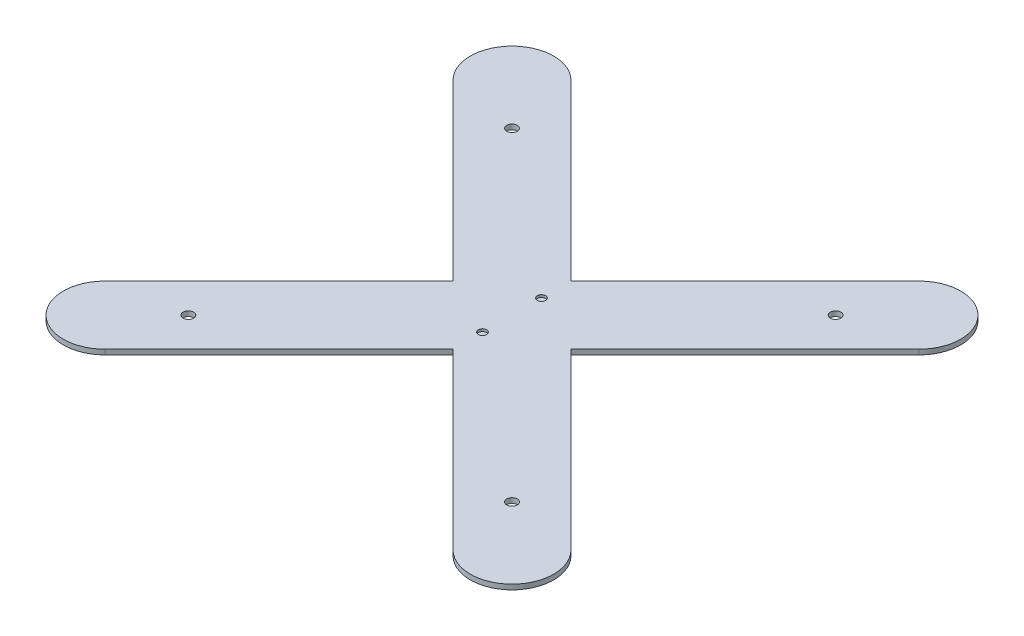
ISO-10303-21;
HEADER;
FILE_DESCRIPTION(('STEP AP214'),'2;1');
FILE_NAME('part.step','',(''),(''),'','','');
FILE_SCHEMA(('AUTOMOTIVE_DESIGN { 1 0 10303 214 1 1 1 1 }'));
ENDSEC;
DATA;
#1=APPLICATION_CONTEXT('core data for automotive mechanical design processes');
#2=APPLICATION_PROTOCOL_DEFINITION('international standard','automotive_design',2000,#1);
#3=PRODUCT_CONTEXT('',#1,'mechanical');
#4=PRODUCT('Part','Part','',(#3));
#5=PRODUCT_RELATED_PRODUCT_CATEGORY('part','',(#4));
#6=PRODUCT_DEFINITION_FORMATION('','',#4);
#7=PRODUCT_DEFINITION_CONTEXT('part definition',#1,'design');
#8=PRODUCT_DEFINITION('design','',#6,#7);
#9=PRODUCT_DEFINITION_SHAPE('','',#8);
#10=(LENGTH_UNIT() NAMED_UNIT(*) SI_UNIT(.MILLI.,.METRE.));
#11=(NAMED_UNIT(*) PLANE_ANGLE_UNIT() SI_UNIT($,.RADIAN.));
#12=(NAMED_UNIT(*) SI_UNIT($,.STERADIAN.) SOLID_ANGLE_UNIT());
#13=UNCERTAINTY_MEASURE_WITH_UNIT(LENGTH_MEASURE(1.E-05),#10,'distance_accuracy_value','');
#14=(GEOMETRIC_REPRESENTATION_CONTEXT(3) GLOBAL_UNCERTAINTY_ASSIGNED_CONTEXT((#13)) GLOBAL_UNIT_ASSIGNED_CONTEXT((#10,
#11,#12)) REPRESENTATION_CONTEXT('',''));
#15=CARTESIAN_POINT('',(0.,0.,0.));
#16=DIRECTION('',(0.,0.,1.));
#17=DIRECTION('',(1.,0.,0.));
#18=AXIS2_PLACEMENT_3D('',#15,#16,#17);
#19=CARTESIAN_POINT('',(122.,3.,122.));
#20=DIRECTION('',(0.,1.,0.));
#21=DIRECTION('',(0.,0.,1.));
#22=AXIS2_PLACEMENT_3D('',#19,#20,#21);
#23=PLANE('',#22);
#24=CARTESIAN_POINT('',(0.,3.,17.6776695296636));
#25=DIRECTION('',(0.,1.,0.));
#26=DIRECTION('',(0.,0.,-1.));
#27=AXIS2_PLACEMENT_3D('',#24,#25,#26);
#28=CIRCLE('',#27,2.5);
#29=CARTESIAN_POINT('',(0.,3.,15.1776695296636));
#30=VERTEX_POINT('',#29);
#31=EDGE_CURVE('E302',#30,#30,#28,.T.);
#32=ORIENTED_EDGE('',*,*,#31,.F.);
#33=EDGE_LOOP('',(#32));
#34=FACE_BOUND('',#33,.T.);
#35=CARTESIAN_POINT('',(0.,3.,-17.6776695296636));
#36=DIRECTION('',(0.,1.,0.));
#37=DIRECTION('',(0.,0.,1.));
#38=AXIS2_PLACEMENT_3D('',#35,#36,#37);
#39=CIRCLE('',#38,2.5);
#40=CARTESIAN_POINT('',(0.,3.,-15.1776695296636));
#41=VERTEX_POINT('',#40);
#42=EDGE_CURVE('E301',#41,#41,#39,.T.);
#43=ORIENTED_EDGE('',*,*,#42,.F.);
#44=EDGE_LOOP('',(#43));
#45=FACE_BOUND('',#44,.T.);
#46=CARTESIAN_POINT('',(96.9999999999999,3.,-97.));
#47=DIRECTION('',(0.,1.,0.));
#48=DIRECTION('',(0.,0.,1.));
#49=AXIS2_PLACEMENT_3D('',#46,#47,#48);
#50=CIRCLE('',#49,3.15);
#51=CARTESIAN_POINT('',(96.9999999999999,3.,-93.85));
#52=VERTEX_POINT('',#51);
#53=EDGE_CURVE('E319',#52,#52,#50,.T.);
#54=ORIENTED_EDGE('',*,*,#53,.F.);
#55=EDGE_LOOP('',(#54));
#56=FACE_BOUND('',#55,.T.);
#57=CARTESIAN_POINT('',(-97.,3.,-96.9999999999999));
#58=DIRECTION('',(0.,1.,0.));
#59=DIRECTION('',(0.,0.,1.));
#60=AXIS2_PLACEMENT_3D('',#57,#58,#59);
#61=CIRCLE('',#60,3.15);
#62=CARTESIAN_POINT('',(-97.,3.,-93.85));
#63=VERTEX_POINT('',#62);
#64=EDGE_CURVE('E158',#63,#63,#61,.T.);
#65=ORIENTED_EDGE('',*,*,#64,.F.);
#66=EDGE_LOOP('',(#65));
#67=FACE_BOUND('',#66,.T.);
#68=CARTESIAN_POINT('',(122.,3.,122.));
#69=DIRECTION('',(0.,1.,0.));
#70=DIRECTION('',(0.,0.,1.));
#71=AXIS2_PLACEMENT_3D('',#68,#69,#70);
#72=CIRCLE('',#71,25.);
#73=CARTESIAN_POINT('',(104.322330470336,3.,139.677669529664));
#74=VERTEX_POINT('',#73);
#75=CARTESIAN_POINT('',(139.677669529664,3.,104.322330470336));
#76=VERTEX_POINT('',#75);
#77=EDGE_CURVE('E177',#74,#76,#72,.T.);
#78=ORIENTED_EDGE('',*,*,#77,.T.);
#79=DIRECTION('',(-0.707106781186547,0.,-0.707106781186548));
#80=VECTOR('',#79,1.);
#81=CARTESIAN_POINT('',(139.677669529664,3.,104.322330470336));
#82=LINE('',#81,#80);
#83=CARTESIAN_POINT('',(35.3553390593272,3.,0.));
#84=VERTEX_POINT('',#83);
#85=EDGE_CURVE('E105',#76,#84,#82,.T.);
#86=ORIENTED_EDGE('',*,*,#85,.T.);
#87=DIRECTION('',(0.707106781186547,0.,-0.707106781186548));
#88=VECTOR('',#87,1.);
#89=CARTESIAN_POINT('',(35.3553390593272,3.,0.));
#90=LINE('',#89,#88);
#91=CARTESIAN_POINT('',(139.677669529664,3.,-104.322330470336));
#92=VERTEX_POINT('',#91);
#93=EDGE_CURVE('E204',#84,#92,#90,.T.);
#94=ORIENTED_EDGE('',*,*,#93,.T.);
#95=CARTESIAN_POINT('',(122.,3.,-122.));
#96=DIRECTION('',(0.,1.,0.));
#97=DIRECTION('',(0.,0.,1.));
#98=AXIS2_PLACEMENT_3D('',#95,#96,#97);
#99=CIRCLE('',#98,24.9999999999999);
#100=CARTESIAN_POINT('',(104.322330470336,3.,-139.677669529664));
#101=VERTEX_POINT('',#100);
#102=EDGE_CURVE('E223',#92,#101,#99,.T.);
#103=ORIENTED_EDGE('',*,*,#102,.T.);
#104=DIRECTION('',(-0.707106781186547,0.,0.707106781186548));
#105=VECTOR('',#104,1.);
#106=CARTESIAN_POINT('',(0.,3.,-35.3553390593272));
#107=LINE('',#106,#105);
#108=CARTESIAN_POINT('',(0.,3.,-35.3553390593272));
#109=VERTEX_POINT('',#108);
#110=EDGE_CURVE('E220',#101,#109,#107,.T.);
#111=ORIENTED_EDGE('',*,*,#110,.T.);
#112=DIRECTION('',(-0.707106781186547,0.,-0.707106781186548));
#113=VECTOR('',#112,1.);
#114=CARTESIAN_POINT('',(0.,3.,-35.3553390593272));
#115=LINE('',#114,#113);
#116=CARTESIAN_POINT('',(-104.322330470336,3.,-139.677669529664));
#117=VERTEX_POINT('',#116);
#118=EDGE_CURVE('E222',#109,#117,#115,.T.);
#119=ORIENTED_EDGE('',*,*,#118,.T.);
#120=CARTESIAN_POINT('',(-122.,3.,-122.));
#121=DIRECTION('',(0.,1.,0.));
#122=DIRECTION('',(0.,0.,1.));
#123=AXIS2_PLACEMENT_3D('',#120,#121,#122);
#124=CIRCLE('',#123,25.);
#125=CARTESIAN_POINT('',(-139.677669529664,3.,-104.322330470336));
#126=VERTEX_POINT('',#125);
#127=EDGE_CURVE('E225',#117,#126,#124,.T.);
#128=ORIENTED_EDGE('',*,*,#127,.T.);
#129=DIRECTION('',(0.707106781186547,0.,0.707106781186548));
#130=VECTOR('',#129,1.);
#131=CARTESIAN_POINT('',(-35.3553390593274,3.,0.));
#132=LINE('',#131,#130);
#133=CARTESIAN_POINT('',(-35.3553390593274,3.,0.));
#134=VERTEX_POINT('',#133);
#135=EDGE_CURVE('E231',#126,#134,#132,.T.);
#136=ORIENTED_EDGE('',*,*,#135,.T.);
#137=DIRECTION('',(-0.707106781186547,0.,0.707106781186548));
#138=VECTOR('',#137,1.);
#139=CARTESIAN_POINT('',(-139.677669529664,3.,104.322330470337));
#140=LINE('',#139,#138);
#141=CARTESIAN_POINT('',(-139.677669529664,3.,104.322330470337));
#142=VERTEX_POINT('',#141);
#143=EDGE_CURVE('E136',#134,#142,#140,.T.);
#144=ORIENTED_EDGE('',*,*,#143,.T.);
#145=CARTESIAN_POINT('',(-122.,3.,122.));
#146=DIRECTION('',(0.,1.,0.));
#147=DIRECTION('',(0.,0.,1.));
#148=AXIS2_PLACEMENT_3D('',#145,#146,#147);
#149=CIRCLE('',#148,24.9999999999999);
#150=CARTESIAN_POINT('',(-104.322330470337,3.,139.677669529664));
#151=VERTEX_POINT('',#150);
#152=EDGE_CURVE('E130',#142,#151,#149,.T.);
#153=ORIENTED_EDGE('',*,*,#152,.T.);
#154=DIRECTION('',(0.707106781186548,0.,-0.707106781186547));
#155=VECTOR('',#154,1.);
#156=CARTESIAN_POINT('',(-104.322330470337,3.,139.677669529664));
#157=LINE('',#156,#155);
#158=CARTESIAN_POINT('',(-1.52655665885959E-13,3.,35.3553390593274));
#159=VERTEX_POINT('',#158);
#160=EDGE_CURVE('E134',#151,#159,#157,.T.);
#161=ORIENTED_EDGE('',*,*,#160,.T.);
#162=DIRECTION('',(0.707106781186548,0.,0.707106781186547));
#163=VECTOR('',#162,1.);
#164=CARTESIAN_POINT('',(104.322330470336,3.,139.677669529664));
#165=LINE('',#164,#163);
#166=EDGE_CURVE('E50',#159,#74,#165,.T.);
#167=ORIENTED_EDGE('',*,*,#166,.T.);
#168=EDGE_LOOP('',(#78,#86,#94,#103,#111,#119,#128,#136,#144,#153,#161,#167));
#169=FACE_BOUND('',#168,.T.);
#170=CARTESIAN_POINT('',(96.9999999999999,3.,97.0000000000001));
#171=DIRECTION('',(0.,1.,0.));
#172=DIRECTION('',(0.,0.,-1.));
#173=AXIS2_PLACEMENT_3D('',#170,#171,#172);
#174=CIRCLE('',#173,3.15);
#175=CARTESIAN_POINT('',(96.9999999999999,3.,93.8500000000001));
#176=VERTEX_POINT('',#175);
#177=EDGE_CURVE('E325',#176,#176,#174,.T.);
#178=ORIENTED_EDGE('',*,*,#177,.F.);
#179=EDGE_LOOP('',(#178));
#180=FACE_BOUND('',#179,.T.);
#181=CARTESIAN_POINT('',(-97.,3.,97.));
#182=DIRECTION('',(0.,1.,0.));
#183=DIRECTION('',(0.,0.,-1.));
#184=AXIS2_PLACEMENT_3D('',#181,#182,#183);
#185=CIRCLE('',#184,3.15);
#186=CARTESIAN_POINT('',(-97.,3.,93.85));
#187=VERTEX_POINT('',#186);
#188=EDGE_CURVE('E313',#187,#187,#185,.T.);
#189=ORIENTED_EDGE('',*,*,#188,.F.);
#190=EDGE_LOOP('',(#189));
#191=FACE_BOUND('',#190,.T.);
#192=ADVANCED_FACE('F33',(#34,#45,#56,#67,#169,#180,#191),#23,.T.);
#193=CARTESIAN_POINT('',(122.,0.,122.));
#194=DIRECTION('',(0.,1.,0.));
#195=DIRECTION('',(0.,0.,1.));
#196=AXIS2_PLACEMENT_3D('',#193,#194,#195);
#197=PLANE('',#196);
#198=CARTESIAN_POINT('',(96.9999999999999,0.,-97.));
#199=DIRECTION('',(0.,1.,0.));
#200=DIRECTION('',(0.,0.,1.));
#201=AXIS2_PLACEMENT_3D('',#198,#199,#200);
#202=CIRCLE('',#201,3.15);
#203=CARTESIAN_POINT('',(96.9999999999999,0.,-93.85));
#204=VERTEX_POINT('',#203);
#205=EDGE_CURVE('E316',#204,#204,#202,.T.);
#206=ORIENTED_EDGE('',*,*,#205,.T.);
#207=EDGE_LOOP('',(#206));
#208=FACE_BOUND('',#207,.T.);
#209=CARTESIAN_POINT('',(-97.,0.,-96.9999999999999));
#210=DIRECTION('',(0.,1.,0.));
#211=DIRECTION('',(0.,0.,1.));
#212=AXIS2_PLACEMENT_3D('',#209,#210,#211);
#213=CIRCLE('',#212,3.15);
#214=CARTESIAN_POINT('',(-97.,0.,-93.85));
#215=VERTEX_POINT('',#214);
#216=EDGE_CURVE('E328',#215,#215,#213,.T.);
#217=ORIENTED_EDGE('',*,*,#216,.T.);
#218=EDGE_LOOP('',(#217));
#219=FACE_BOUND('',#218,.T.);
#220=CARTESIAN_POINT('',(122.,0.,122.));
#221=DIRECTION('',(0.,1.,0.));
#222=DIRECTION('',(0.,0.,1.));
#223=AXIS2_PLACEMENT_3D('',#220,#221,#222);
#224=CIRCLE('',#223,25.);
#225=CARTESIAN_POINT('',(104.322330470336,0.,139.677669529664));
#226=VERTEX_POINT('',#225);
#227=CARTESIAN_POINT('',(139.677669529664,0.,104.322330470336));
#228=VERTEX_POINT('',#227);
#229=EDGE_CURVE('E154',#226,#228,#224,.T.);
#230=ORIENTED_EDGE('',*,*,#229,.F.);
#231=DIRECTION('',(0.707106781186548,0.,0.707106781186547));
#232=VECTOR('',#231,1.);
#233=CARTESIAN_POINT('',(104.322330470336,0.,139.677669529664));
#234=LINE('',#233,#232);
#235=CARTESIAN_POINT('',(-1.52655665885959E-13,0.,35.3553390593274));
#236=VERTEX_POINT('',#235);
#237=EDGE_CURVE('E97',#236,#226,#234,.T.);
#238=ORIENTED_EDGE('',*,*,#237,.F.);
#239=DIRECTION('',(0.707106781186548,0.,-0.707106781186547));
#240=VECTOR('',#239,1.);
#241=CARTESIAN_POINT('',(-104.322330470337,0.,139.677669529664));
#242=LINE('',#241,#240);
#243=CARTESIAN_POINT('',(-104.322330470337,0.,139.677669529664));
#244=VERTEX_POINT('',#243);
#245=EDGE_CURVE('E91',#244,#236,#242,.T.);
#246=ORIENTED_EDGE('',*,*,#245,.F.);
#247=CARTESIAN_POINT('',(-122.,0.,122.));
#248=DIRECTION('',(0.,1.,0.));
#249=DIRECTION('',(0.,0.,1.));
#250=AXIS2_PLACEMENT_3D('',#247,#248,#249);
#251=CIRCLE('',#250,24.9999999999999);
#252=CARTESIAN_POINT('',(-139.677669529664,0.,104.322330470337));
#253=VERTEX_POINT('',#252);
#254=EDGE_CURVE('E144',#253,#244,#251,.T.);
#255=ORIENTED_EDGE('',*,*,#254,.F.);
#256=DIRECTION('',(-0.707106781186547,0.,0.707106781186548));
#257=VECTOR('',#256,1.);
#258=CARTESIAN_POINT('',(-139.677669529664,0.,104.322330470337));
#259=LINE('',#258,#257);
#260=CARTESIAN_POINT('',(-35.3553390593274,0.,0.));
#261=VERTEX_POINT('',#260);
#262=EDGE_CURVE('E172',#261,#253,#259,.T.);
#263=ORIENTED_EDGE('',*,*,#262,.F.);
#264=DIRECTION('',(0.707106781186547,0.,0.707106781186548));
#265=VECTOR('',#264,1.);
#266=CARTESIAN_POINT('',(-35.3553390593274,0.,0.));
#267=LINE('',#266,#265);
#268=CARTESIAN_POINT('',(-139.677669529664,0.,-104.322330470336));
#269=VERTEX_POINT('',#268);
#270=EDGE_CURVE('E170',#269,#261,#267,.T.);
#271=ORIENTED_EDGE('',*,*,#270,.F.);
#272=CARTESIAN_POINT('',(-122.,0.,-122.));
#273=DIRECTION('',(0.,1.,0.));
#274=DIRECTION('',(0.,0.,1.));
#275=AXIS2_PLACEMENT_3D('',#272,#273,#274);
#276=CIRCLE('',#275,25.);
#277=CARTESIAN_POINT('',(-104.322330470336,0.,-139.677669529664));
#278=VERTEX_POINT('',#277);
#279=EDGE_CURVE('E168',#278,#269,#276,.T.);
#280=ORIENTED_EDGE('',*,*,#279,.F.);
#281=DIRECTION('',(-0.707106781186547,0.,-0.707106781186548));
#282=VECTOR('',#281,1.);
#283=CARTESIAN_POINT('',(0.,0.,-35.3553390593272));
#284=LINE('',#283,#282);
#285=CARTESIAN_POINT('',(0.,0.,-35.3553390593272));
#286=VERTEX_POINT('',#285);
#287=EDGE_CURVE('E166',#286,#278,#284,.T.);
#288=ORIENTED_EDGE('',*,*,#287,.F.);
#289=DIRECTION('',(-0.707106781186547,0.,0.707106781186548));
#290=VECTOR('',#289,1.);
#291=CARTESIAN_POINT('',(0.,0.,-35.3553390593272));
#292=LINE('',#291,#290);
#293=CARTESIAN_POINT('',(104.322330470336,0.,-139.677669529664));
#294=VERTEX_POINT('',#293);
#295=EDGE_CURVE('E164',#294,#286,#292,.T.);
#296=ORIENTED_EDGE('',*,*,#295,.F.);
#297=CARTESIAN_POINT('',(122.,0.,-122.));
#298=DIRECTION('',(0.,1.,0.));
#299=DIRECTION('',(0.,0.,1.));
#300=AXIS2_PLACEMENT_3D('',#297,#298,#299);
#301=CIRCLE('',#300,24.9999999999999);
#302=CARTESIAN_POINT('',(139.677669529664,0.,-104.322330470336));
#303=VERTEX_POINT('',#302);
#304=EDGE_CURVE('E162',#303,#294,#301,.T.);
#305=ORIENTED_EDGE('',*,*,#304,.F.);
#306=DIRECTION('',(0.707106781186547,0.,-0.707106781186548));
#307=VECTOR('',#306,1.);
#308=CARTESIAN_POINT('',(35.3553390593272,0.,0.));
#309=LINE('',#308,#307);
#310=CARTESIAN_POINT('',(35.3553390593272,0.,0.));
#311=VERTEX_POINT('',#310);
#312=EDGE_CURVE('E160',#311,#303,#309,.T.);
#313=ORIENTED_EDGE('',*,*,#312,.F.);
#314=DIRECTION('',(-0.707106781186547,0.,-0.707106781186548));
#315=VECTOR('',#314,1.);
#316=CARTESIAN_POINT('',(139.677669529664,0.,104.322330470336));
#317=LINE('',#316,#315);
#318=EDGE_CURVE('E157',#228,#311,#317,.T.);
#319=ORIENTED_EDGE('',*,*,#318,.F.);
#320=EDGE_LOOP('',(#230,#238,#246,#255,#263,#271,#280,#288,#296,#305,#313,#319));
#321=FACE_BOUND('',#320,.T.);
#322=CARTESIAN_POINT('',(96.9999999999999,0.,97.0000000000001));
#323=DIRECTION('',(0.,1.,0.));
#324=DIRECTION('',(0.,0.,-1.));
#325=AXIS2_PLACEMENT_3D('',#322,#323,#324);
#326=CIRCLE('',#325,3.15);
#327=CARTESIAN_POINT('',(96.9999999999999,0.,93.8500000000001));
#328=VERTEX_POINT('',#327);
#329=EDGE_CURVE('E322',#328,#328,#326,.T.);
#330=ORIENTED_EDGE('',*,*,#329,.T.);
#331=EDGE_LOOP('',(#330));
#332=FACE_BOUND('',#331,.T.);
#333=CARTESIAN_POINT('',(-97.,0.,97.));
#334=DIRECTION('',(0.,1.,0.));
#335=DIRECTION('',(0.,0.,-1.));
#336=AXIS2_PLACEMENT_3D('',#333,#334,#335);
#337=CIRCLE('',#336,3.15);
#338=CARTESIAN_POINT('',(-97.,0.,93.85));
#339=VERTEX_POINT('',#338);
#340=EDGE_CURVE('E311',#339,#339,#337,.T.);
#341=ORIENTED_EDGE('',*,*,#340,.T.);
#342=EDGE_LOOP('',(#341));
#343=FACE_BOUND('',#342,.T.);
#344=ADVANCED_FACE('F208',(#208,#219,#321,#332,#343),#197,.F.);
#345=CARTESIAN_POINT('',(122.,3.,122.));
#346=DIRECTION('',(0.,-1.,0.));
#347=DIRECTION('',(0.,0.,-1.));
#348=AXIS2_PLACEMENT_3D('',#345,#346,#347);
#349=CYLINDRICAL_SURFACE('',#348,25.);
#350=ORIENTED_EDGE('',*,*,#229,.T.);
#351=DIRECTION('',(0.,-1.,0.));
#352=VECTOR('',#351,1.);
#353=CARTESIAN_POINT('',(139.677669529664,3.,104.322330470336));
#354=LINE('',#353,#352);
#355=EDGE_CURVE('E11',#76,#228,#354,.T.);
#356=ORIENTED_EDGE('',*,*,#355,.F.);
#357=ORIENTED_EDGE('',*,*,#77,.F.);
#358=DIRECTION('',(0.,-1.,0.));
#359=VECTOR('',#358,1.);
#360=CARTESIAN_POINT('',(104.322330470336,3.,139.677669529664));
#361=LINE('',#360,#359);
#362=EDGE_CURVE('E150',#74,#226,#361,.T.);
#363=ORIENTED_EDGE('',*,*,#362,.T.);
#364=EDGE_LOOP('',(#350,#356,#357,#363));
#365=FACE_BOUND('',#364,.T.);
#366=ADVANCED_FACE('F35',(#365),#349,.T.);
#367=CARTESIAN_POINT('',(139.677669529664,3.,104.322330470336));
#368=DIRECTION('',(-0.707106781186548,0.,0.707106781186547));
#369=DIRECTION('',(0.707106781186547,0.,0.707106781186548));
#370=AXIS2_PLACEMENT_3D('',#367,#368,#369);
#371=PLANE('',#370);
#372=ORIENTED_EDGE('',*,*,#318,.T.);
#373=DIRECTION('',(0.,-1.,0.));
#374=VECTOR('',#373,1.);
#375=CARTESIAN_POINT('',(35.3553390593272,3.,0.));
#376=LINE('',#375,#374);
#377=EDGE_CURVE('E42',#84,#311,#376,.T.);
#378=ORIENTED_EDGE('',*,*,#377,.F.);
#379=ORIENTED_EDGE('',*,*,#85,.F.);
#380=ORIENTED_EDGE('',*,*,#355,.T.);
#381=EDGE_LOOP('',(#372,#378,#379,#380));
#382=FACE_BOUND('',#381,.T.);
#383=ADVANCED_FACE('F462',(#382),#371,.F.);
#384=CARTESIAN_POINT('',(35.3553390593272,3.,0.));
#385=DIRECTION('',(-0.707106781186548,0.,-0.707106781186547));
#386=DIRECTION('',(-0.707106781186547,0.,0.707106781186548));
#387=AXIS2_PLACEMENT_3D('',#384,#385,#386);
#388=PLANE('',#387);
#389=ORIENTED_EDGE('',*,*,#312,.T.);
#390=DIRECTION('',(0.,-1.,0.));
#391=VECTOR('',#390,1.);
#392=CARTESIAN_POINT('',(139.677669529664,3.,-104.322330470336));
#393=LINE('',#392,#391);
#394=EDGE_CURVE('E196',#92,#303,#393,.T.);
#395=ORIENTED_EDGE('',*,*,#394,.F.);
#396=ORIENTED_EDGE('',*,*,#93,.F.);
#397=ORIENTED_EDGE('',*,*,#377,.T.);
#398=EDGE_LOOP('',(#389,#395,#396,#397));
#399=FACE_BOUND('',#398,.T.);
#400=ADVANCED_FACE('F202',(#399),#388,.F.);
#401=CARTESIAN_POINT('',(122.,3.,-122.));
#402=DIRECTION('',(0.,-1.,0.));
#403=DIRECTION('',(0.,0.,-1.));
#404=AXIS2_PLACEMENT_3D('',#401,#402,#403);
#405=CYLINDRICAL_SURFACE('',#404,24.9999999999999);
#406=ORIENTED_EDGE('',*,*,#304,.T.);
#407=DIRECTION('',(0.,-1.,0.));
#408=VECTOR('',#407,1.);
#409=CARTESIAN_POINT('',(104.322330470336,3.,-139.677669529664));
#410=LINE('',#409,#408);
#411=EDGE_CURVE('E193',#101,#294,#410,.T.);
#412=ORIENTED_EDGE('',*,*,#411,.F.);
#413=ORIENTED_EDGE('',*,*,#102,.F.);
#414=ORIENTED_EDGE('',*,*,#394,.T.);
#415=EDGE_LOOP('',(#406,#412,#413,#414));
#416=FACE_BOUND('',#415,.T.);
#417=ADVANCED_FACE('F214',(#416),#405,.T.);
#418=CARTESIAN_POINT('',(0.,3.,-35.3553390593272));
#419=DIRECTION('',(0.707106781186548,0.,0.707106781186547));
#420=DIRECTION('',(0.707106781186547,0.,-0.707106781186548));
#421=AXIS2_PLACEMENT_3D('',#418,#419,#420);
#422=PLANE('',#421);
#423=ORIENTED_EDGE('',*,*,#295,.T.);
#424=DIRECTION('',(0.,-1.,0.));
#425=VECTOR('',#424,1.);
#426=CARTESIAN_POINT('',(0.,3.,-35.3553390593272));
#427=LINE('',#426,#425);
#428=EDGE_CURVE('E190',#109,#286,#427,.T.);
#429=ORIENTED_EDGE('',*,*,#428,.F.);
#430=ORIENTED_EDGE('',*,*,#110,.F.);
#431=ORIENTED_EDGE('',*,*,#411,.T.);
#432=EDGE_LOOP('',(#423,#429,#430,#431));
#433=FACE_BOUND('',#432,.T.);
#434=ADVANCED_FACE('F218',(#433),#422,.F.);
#435=CARTESIAN_POINT('',(0.,3.,-35.3553390593272));
#436=DIRECTION('',(-0.707106781186548,0.,0.707106781186547));
#437=DIRECTION('',(0.707106781186547,0.,0.707106781186548));
#438=AXIS2_PLACEMENT_3D('',#435,#436,#437);
#439=PLANE('',#438);
#440=ORIENTED_EDGE('',*,*,#287,.T.);
#441=DIRECTION('',(0.,-1.,0.));
#442=VECTOR('',#441,1.);
#443=CARTESIAN_POINT('',(-104.322330470336,3.,-139.677669529664));
#444=LINE('',#443,#442);
#445=EDGE_CURVE('E187',#117,#278,#444,.T.);
#446=ORIENTED_EDGE('',*,*,#445,.F.);
#447=ORIENTED_EDGE('',*,*,#118,.F.);
#448=ORIENTED_EDGE('',*,*,#428,.T.);
#449=EDGE_LOOP('',(#440,#446,#447,#448));
#450=FACE_BOUND('',#449,.T.);
#451=ADVANCED_FACE('F427',(#450),#439,.F.);
#452=CARTESIAN_POINT('',(-122.,3.,-122.));
#453=DIRECTION('',(0.,-1.,0.));
#454=DIRECTION('',(0.,0.,-1.));
#455=AXIS2_PLACEMENT_3D('',#452,#453,#454);
#456=CYLINDRICAL_SURFACE('',#455,25.);
#457=ORIENTED_EDGE('',*,*,#279,.T.);
#458=DIRECTION('',(0.,-1.,0.));
#459=VECTOR('',#458,1.);
#460=CARTESIAN_POINT('',(-139.677669529664,3.,-104.322330470336));
#461=LINE('',#460,#459);
#462=EDGE_CURVE('E184',#126,#269,#461,.T.);
#463=ORIENTED_EDGE('',*,*,#462,.F.);
#464=ORIENTED_EDGE('',*,*,#127,.F.);
#465=ORIENTED_EDGE('',*,*,#445,.T.);
#466=EDGE_LOOP('',(#457,#463,#464,#465));
#467=FACE_BOUND('',#466,.T.);
#468=ADVANCED_FACE('F418',(#467),#456,.T.);
#469=CARTESIAN_POINT('',(-35.3553390593274,3.,0.));
#470=DIRECTION('',(0.707106781186548,0.,-0.707106781186547));
#471=DIRECTION('',(-0.707106781186547,0.,-0.707106781186548));
#472=AXIS2_PLACEMENT_3D('',#469,#470,#471);
#473=PLANE('',#472);
#474=ORIENTED_EDGE('',*,*,#270,.T.);
#475=DIRECTION('',(0.,-1.,0.));
#476=VECTOR('',#475,1.);
#477=CARTESIAN_POINT('',(-35.3553390593274,3.,0.));
#478=LINE('',#477,#476);
#479=EDGE_CURVE('E181',#134,#261,#478,.T.);
#480=ORIENTED_EDGE('',*,*,#479,.F.);
#481=ORIENTED_EDGE('',*,*,#135,.F.);
#482=ORIENTED_EDGE('',*,*,#462,.T.);
#483=EDGE_LOOP('',(#474,#480,#481,#482));
#484=FACE_BOUND('',#483,.T.);
#485=ADVANCED_FACE('F237',(#484),#473,.F.);
#486=CARTESIAN_POINT('',(-139.677669529664,3.,104.322330470337));
#487=DIRECTION('',(0.707106781186548,0.,0.707106781186547));
#488=DIRECTION('',(0.707106781186547,0.,-0.707106781186548));
#489=AXIS2_PLACEMENT_3D('',#486,#487,#488);
#490=PLANE('',#489);
#491=ORIENTED_EDGE('',*,*,#262,.T.);
#492=DIRECTION('',(0.,-1.,0.));
#493=VECTOR('',#492,1.);
#494=CARTESIAN_POINT('',(-139.677669529664,3.,104.322330470337));
#495=LINE('',#494,#493);
#496=EDGE_CURVE('E145',#142,#253,#495,.T.);
#497=ORIENTED_EDGE('',*,*,#496,.F.);
#498=ORIENTED_EDGE('',*,*,#143,.F.);
#499=ORIENTED_EDGE('',*,*,#479,.T.);
#500=EDGE_LOOP('',(#491,#497,#498,#499));
#501=FACE_BOUND('',#500,.T.);
#502=ADVANCED_FACE('F241',(#501),#490,.F.);
#503=CARTESIAN_POINT('',(-122.,3.,122.));
#504=DIRECTION('',(0.,-1.,0.));
#505=DIRECTION('',(0.,0.,-1.));
#506=AXIS2_PLACEMENT_3D('',#503,#504,#505);
#507=CYLINDRICAL_SURFACE('',#506,24.9999999999999);
#508=ORIENTED_EDGE('',*,*,#254,.T.);
#509=DIRECTION('',(0.,-1.,0.));
#510=VECTOR('',#509,1.);
#511=CARTESIAN_POINT('',(-104.322330470337,3.,139.677669529664));
#512=LINE('',#511,#510);
#513=EDGE_CURVE('E141',#151,#244,#512,.T.);
#514=ORIENTED_EDGE('',*,*,#513,.F.);
#515=ORIENTED_EDGE('',*,*,#152,.F.);
#516=ORIENTED_EDGE('',*,*,#496,.T.);
#517=EDGE_LOOP('',(#508,#514,#515,#516));
#518=FACE_BOUND('',#517,.T.);
#519=ADVANCED_FACE('F142',(#518),#507,.T.);
#520=CARTESIAN_POINT('',(-104.322330470337,3.,139.677669529664));
#521=DIRECTION('',(-0.707106781186547,0.,-0.707106781186548));
#522=DIRECTION('',(-0.707106781186548,0.,0.707106781186547));
#523=AXIS2_PLACEMENT_3D('',#520,#521,#522);
#524=PLANE('',#523);
#525=ORIENTED_EDGE('',*,*,#245,.T.);
#526=DIRECTION('',(0.,-1.,0.));
#527=VECTOR('',#526,1.);
#528=CARTESIAN_POINT('',(-1.52655665885959E-13,3.,35.3553390593274));
#529=LINE('',#528,#527);
#530=EDGE_CURVE('E146',#159,#236,#529,.T.);
#531=ORIENTED_EDGE('',*,*,#530,.F.);
#532=ORIENTED_EDGE('',*,*,#160,.F.);
#533=ORIENTED_EDGE('',*,*,#513,.T.);
#534=EDGE_LOOP('',(#525,#531,#532,#533));
#535=FACE_BOUND('',#534,.T.);
#536=ADVANCED_FACE('F148',(#535),#524,.F.);
#537=CARTESIAN_POINT('',(104.322330470336,3.,139.677669529664));
#538=DIRECTION('',(0.707106781186547,0.,-0.707106781186548));
#539=DIRECTION('',(-0.707106781186548,0.,-0.707106781186547));
#540=AXIS2_PLACEMENT_3D('',#537,#538,#539);
#541=PLANE('',#540);
#542=ORIENTED_EDGE('',*,*,#237,.T.);
#543=ORIENTED_EDGE('',*,*,#362,.F.);
#544=ORIENTED_EDGE('',*,*,#166,.F.);
#545=ORIENTED_EDGE('',*,*,#530,.T.);
#546=EDGE_LOOP('',(#542,#543,#544,#545));
#547=FACE_BOUND('',#546,.T.);
#548=ADVANCED_FACE('F245',(#547),#541,.F.);
#549=CARTESIAN_POINT('',(-97.,3.,-96.9999999999999));
#550=DIRECTION('',(0.,-1.,0.));
#551=DIRECTION('',(0.,0.,-1.));
#552=AXIS2_PLACEMENT_3D('',#549,#550,#551);
#553=CYLINDRICAL_SURFACE('',#552,3.15);
#554=ORIENTED_EDGE('',*,*,#64,.T.);
#555=EDGE_LOOP('',(#554));
#556=FACE_BOUND('',#555,.T.);
#557=ORIENTED_EDGE('',*,*,#216,.F.);
#558=EDGE_LOOP('',(#557));
#559=FACE_BOUND('',#558,.T.);
#560=ADVANCED_FACE('F247',(#556,#559),#553,.F.);
#561=CARTESIAN_POINT('',(96.9999999999999,3.,97.0000000000001));
#562=DIRECTION('',(0.,-1.,0.));
#563=DIRECTION('',(0.,0.,-1.));
#564=AXIS2_PLACEMENT_3D('',#561,#562,#563);
#565=CYLINDRICAL_SURFACE('',#564,3.15);
#566=ORIENTED_EDGE('',*,*,#177,.T.);
#567=EDGE_LOOP('',(#566));
#568=FACE_BOUND('',#567,.T.);
#569=ORIENTED_EDGE('',*,*,#329,.F.);
#570=EDGE_LOOP('',(#569));
#571=FACE_BOUND('',#570,.T.);
#572=ADVANCED_FACE('F253',(#568,#571),#565,.F.);
#573=CARTESIAN_POINT('',(96.9999999999999,3.,-97.));
#574=DIRECTION('',(0.,-1.,0.));
#575=DIRECTION('',(0.,0.,-1.));
#576=AXIS2_PLACEMENT_3D('',#573,#574,#575);
#577=CYLINDRICAL_SURFACE('',#576,3.15);
#578=ORIENTED_EDGE('',*,*,#53,.T.);
#579=EDGE_LOOP('',(#578));
#580=FACE_BOUND('',#579,.T.);
#581=ORIENTED_EDGE('',*,*,#205,.F.);
#582=EDGE_LOOP('',(#581));
#583=FACE_BOUND('',#582,.T.);
#584=ADVANCED_FACE('F272',(#580,#583),#577,.F.);
#585=CARTESIAN_POINT('',(-97.,3.,97.));
#586=DIRECTION('',(0.,-1.,0.));
#587=DIRECTION('',(0.,0.,-1.));
#588=AXIS2_PLACEMENT_3D('',#585,#586,#587);
#589=CYLINDRICAL_SURFACE('',#588,3.15);
#590=ORIENTED_EDGE('',*,*,#188,.T.);
#591=EDGE_LOOP('',(#590));
#592=FACE_BOUND('',#591,.T.);
#593=ORIENTED_EDGE('',*,*,#340,.F.);
#594=EDGE_LOOP('',(#593));
#595=FACE_BOUND('',#594,.T.);
#596=ADVANCED_FACE('F276',(#592,#595),#589,.F.);
#597=CARTESIAN_POINT('',(0.,1.5,-17.6776695296636));
#598=DIRECTION('',(0.,1.,0.));
#599=DIRECTION('',(0.,0.,1.));
#600=AXIS2_PLACEMENT_3D('',#597,#598,#599);
#601=CYLINDRICAL_SURFACE('',#600,2.5);
#602=CARTESIAN_POINT('',(0.,1.5,-17.6776695296636));
#603=DIRECTION('',(0.,1.,0.));
#604=DIRECTION('',(0.,0.,1.));
#605=AXIS2_PLACEMENT_3D('',#602,#603,#604);
#606=CIRCLE('',#605,2.5);
#607=CARTESIAN_POINT('',(0.,1.5,-15.1776695296636));
#608=VERTEX_POINT('',#607);
#609=EDGE_CURVE('E305',#608,#608,#606,.T.);
#610=ORIENTED_EDGE('',*,*,#609,.F.);
#611=EDGE_LOOP('',(#610));
#612=FACE_BOUND('',#611,.T.);
#613=ORIENTED_EDGE('',*,*,#42,.T.);
#614=EDGE_LOOP('',(#613));
#615=FACE_BOUND('',#614,.T.);
#616=ADVANCED_FACE('F280',(#612,#615),#601,.F.);
#617=CARTESIAN_POINT('',(0.,1.5,-17.6776695296636));
#618=DIRECTION('',(0.,1.,0.));
#619=DIRECTION('',(0.,0.,1.));
#620=AXIS2_PLACEMENT_3D('',#617,#618,#619);
#621=PLANE('',#620);
#622=ORIENTED_EDGE('',*,*,#609,.T.);
#623=EDGE_LOOP('',(#622));
#624=FACE_BOUND('',#623,.T.);
#625=ADVANCED_FACE('F284',(#624),#621,.T.);
#626=CARTESIAN_POINT('',(0.,1.5,17.6776695296636));
#627=DIRECTION('',(0.,1.,0.));
#628=DIRECTION('',(0.,0.,1.));
#629=AXIS2_PLACEMENT_3D('',#626,#627,#628);
#630=CYLINDRICAL_SURFACE('',#629,2.5);
#631=CARTESIAN_POINT('',(0.,1.5,17.6776695296636));
#632=DIRECTION('',(0.,1.,0.));
#633=DIRECTION('',(0.,0.,-1.));
#634=AXIS2_PLACEMENT_3D('',#631,#632,#633);
#635=CIRCLE('',#634,2.5);
#636=CARTESIAN_POINT('',(0.,1.5,15.1776695296636));
#637=VERTEX_POINT('',#636);
#638=EDGE_CURVE('E300',#637,#637,#635,.T.);
#639=ORIENTED_EDGE('',*,*,#638,.F.);
#640=EDGE_LOOP('',(#639));
#641=FACE_BOUND('',#640,.T.);
#642=ORIENTED_EDGE('',*,*,#31,.T.);
#643=EDGE_LOOP('',(#642));
#644=FACE_BOUND('',#643,.T.);
#645=ADVANCED_FACE('F288',(#641,#644),#630,.F.);
#646=CARTESIAN_POINT('',(0.,1.5,17.6776695296636));
#647=DIRECTION('',(0.,-1.,0.));
#648=DIRECTION('',(0.,0.,-1.));
#649=AXIS2_PLACEMENT_3D('',#646,#647,#648);
#650=PLANE('',#649);
#651=ORIENTED_EDGE('',*,*,#638,.T.);
#652=EDGE_LOOP('',(#651));
#653=FACE_BOUND('',#652,.T.);
#654=ADVANCED_FACE('F292',(#653),#650,.F.);
#655=CLOSED_SHELL('',(#192,#344,#366,#383,#400,#417,#434,#451,#468,#485,#502,#519,#536,#548,
#560,#572,#584,#596,#616,#625,#645,#654));
#656=MANIFOLD_SOLID_BREP('B2',#655);
#657=ADVANCED_BREP_SHAPE_REPRESENTATION('',(#18,#656),#14);
#658=SHAPE_DEFINITION_REPRESENTATION(#9,#657);
ENDSEC;
END-ISO-10303-21;
